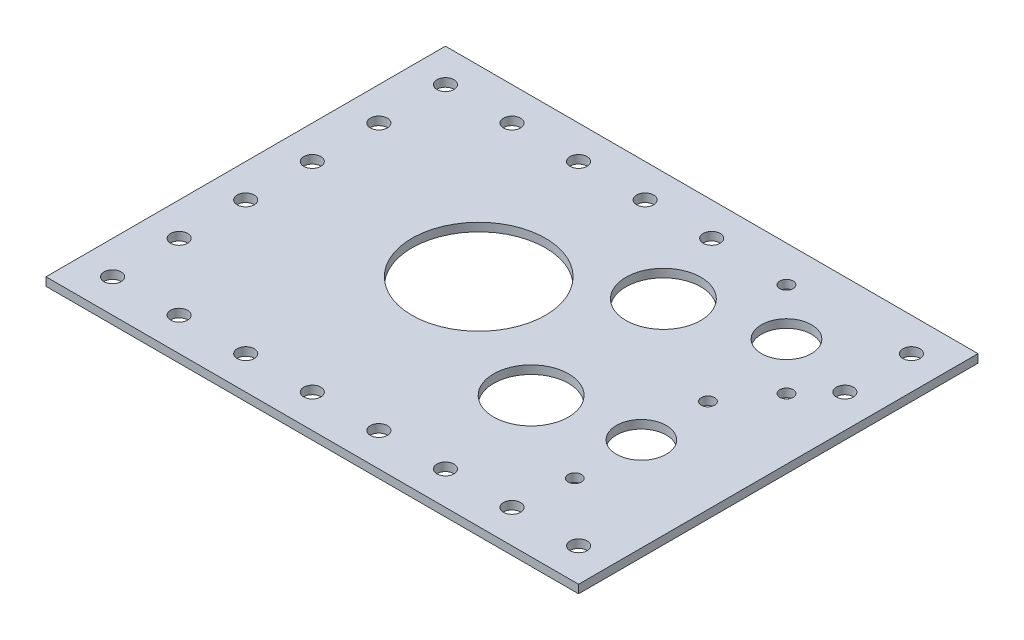
ISO-10303-21;
HEADER;
FILE_DESCRIPTION(('STEP AP214'),'2;1');
FILE_NAME('part.step','',(''),(''),'','','');
FILE_SCHEMA(('AUTOMOTIVE_DESIGN { 1 0 10303 214 1 1 1 1 }'));
ENDSEC;
DATA;
#1=APPLICATION_CONTEXT('core data for automotive mechanical design processes');
#2=APPLICATION_PROTOCOL_DEFINITION('international standard','automotive_design',2000,#1);
#3=PRODUCT_CONTEXT('',#1,'mechanical');
#4=PRODUCT('Part','Part','',(#3));
#5=PRODUCT_RELATED_PRODUCT_CATEGORY('part','',(#4));
#6=PRODUCT_DEFINITION_FORMATION('','',#4);
#7=PRODUCT_DEFINITION_CONTEXT('part definition',#1,'design');
#8=PRODUCT_DEFINITION('design','',#6,#7);
#9=PRODUCT_DEFINITION_SHAPE('','',#8);
#10=(LENGTH_UNIT() NAMED_UNIT(*) SI_UNIT(.MILLI.,.METRE.));
#11=(NAMED_UNIT(*) PLANE_ANGLE_UNIT() SI_UNIT($,.RADIAN.));
#12=(NAMED_UNIT(*) SI_UNIT($,.STERADIAN.) SOLID_ANGLE_UNIT());
#13=UNCERTAINTY_MEASURE_WITH_UNIT(LENGTH_MEASURE(1.E-05),#10,'distance_accuracy_value','');
#14=(GEOMETRIC_REPRESENTATION_CONTEXT(3) GLOBAL_UNCERTAINTY_ASSIGNED_CONTEXT((#13)) GLOBAL_UNIT_ASSIGNED_CONTEXT((#10,
#11,#12)) REPRESENTATION_CONTEXT('',''));
#15=CARTESIAN_POINT('',(0.,0.,0.));
#16=DIRECTION('',(0.,0.,1.));
#17=DIRECTION('',(1.,0.,0.));
#18=AXIS2_PLACEMENT_3D('',#15,#16,#17);
#19=CARTESIAN_POINT('',(0.,3.175,0.));
#20=DIRECTION('',(1.,0.,0.));
#21=DIRECTION('',(0.,0.,-1.));
#22=AXIS2_PLACEMENT_3D('',#19,#20,#21);
#23=PLANE('',#22);
#24=DIRECTION('',(0.,0.,1.));
#25=VECTOR('',#24,1.);
#26=CARTESIAN_POINT('',(0.,0.,0.));
#27=LINE('',#26,#25);
#28=CARTESIAN_POINT('',(0.,0.,-152.4));
#29=VERTEX_POINT('',#28);
#30=CARTESIAN_POINT('',(0.,0.,0.));
#31=VERTEX_POINT('',#30);
#32=EDGE_CURVE('E103',#29,#31,#27,.T.);
#33=ORIENTED_EDGE('',*,*,#32,.T.);
#34=DIRECTION('',(0.,-1.,0.));
#35=VECTOR('',#34,1.);
#36=CARTESIAN_POINT('',(0.,3.175,0.));
#37=LINE('',#36,#35);
#38=CARTESIAN_POINT('',(0.,3.175,0.));
#39=VERTEX_POINT('',#38);
#40=EDGE_CURVE('E11',#39,#31,#37,.T.);
#41=ORIENTED_EDGE('',*,*,#40,.F.);
#42=DIRECTION('',(0.,0.,1.));
#43=VECTOR('',#42,1.);
#44=CARTESIAN_POINT('',(0.,3.175,0.));
#45=LINE('',#44,#43);
#46=CARTESIAN_POINT('',(0.,3.175,-152.4));
#47=VERTEX_POINT('',#46);
#48=EDGE_CURVE('E90',#47,#39,#45,.T.);
#49=ORIENTED_EDGE('',*,*,#48,.F.);
#50=DIRECTION('',(0.,-1.,0.));
#51=VECTOR('',#50,1.);
#52=CARTESIAN_POINT('',(0.,3.175,-152.4));
#53=LINE('',#52,#51);
#54=EDGE_CURVE('E99',#47,#29,#53,.T.);
#55=ORIENTED_EDGE('',*,*,#54,.T.);
#56=EDGE_LOOP('',(#33,#41,#49,#55));
#57=FACE_BOUND('',#56,.T.);
#58=ADVANCED_FACE('F37',(#57),#23,.F.);
#59=CARTESIAN_POINT('',(0.,3.175,0.));
#60=DIRECTION('',(0.,0.,-1.));
#61=DIRECTION('',(-1.,0.,0.));
#62=AXIS2_PLACEMENT_3D('',#59,#60,#61);
#63=PLANE('',#62);
#64=DIRECTION('',(1.,0.,0.));
#65=VECTOR('',#64,1.);
#66=CARTESIAN_POINT('',(0.,0.,0.));
#67=LINE('',#66,#65);
#68=CARTESIAN_POINT('',(203.2,0.,0.));
#69=VERTEX_POINT('',#68);
#70=EDGE_CURVE('E94',#31,#69,#67,.T.);
#71=ORIENTED_EDGE('',*,*,#70,.T.);
#72=DIRECTION('',(0.,-1.,0.));
#73=VECTOR('',#72,1.);
#74=CARTESIAN_POINT('',(203.2,3.175,0.));
#75=LINE('',#74,#73);
#76=CARTESIAN_POINT('',(203.2,3.175,0.));
#77=VERTEX_POINT('',#76);
#78=EDGE_CURVE('E46',#77,#69,#75,.T.);
#79=ORIENTED_EDGE('',*,*,#78,.F.);
#80=DIRECTION('',(1.,0.,0.));
#81=VECTOR('',#80,1.);
#82=CARTESIAN_POINT('',(0.,3.175,0.));
#83=LINE('',#82,#81);
#84=EDGE_CURVE('E85',#39,#77,#83,.T.);
#85=ORIENTED_EDGE('',*,*,#84,.F.);
#86=ORIENTED_EDGE('',*,*,#40,.T.);
#87=EDGE_LOOP('',(#71,#79,#85,#86));
#88=FACE_BOUND('',#87,.T.);
#89=ADVANCED_FACE('F93',(#88),#63,.F.);
#90=CARTESIAN_POINT('',(203.2,3.175,0.));
#91=DIRECTION('',(-1.,0.,0.));
#92=DIRECTION('',(0.,0.,1.));
#93=AXIS2_PLACEMENT_3D('',#90,#91,#92);
#94=PLANE('',#93);
#95=DIRECTION('',(0.,0.,-1.));
#96=VECTOR('',#95,1.);
#97=CARTESIAN_POINT('',(203.2,0.,0.));
#98=LINE('',#97,#96);
#99=CARTESIAN_POINT('',(203.2,0.,-152.4));
#100=VERTEX_POINT('',#99);
#101=EDGE_CURVE('E72',#69,#100,#98,.T.);
#102=ORIENTED_EDGE('',*,*,#101,.T.);
#103=DIRECTION('',(0.,-1.,0.));
#104=VECTOR('',#103,1.);
#105=CARTESIAN_POINT('',(203.2,3.175,-152.4));
#106=LINE('',#105,#104);
#107=CARTESIAN_POINT('',(203.2,3.175,-152.4));
#108=VERTEX_POINT('',#107);
#109=EDGE_CURVE('E95',#108,#100,#106,.T.);
#110=ORIENTED_EDGE('',*,*,#109,.F.);
#111=DIRECTION('',(0.,0.,-1.));
#112=VECTOR('',#111,1.);
#113=CARTESIAN_POINT('',(203.2,3.175,0.));
#114=LINE('',#113,#112);
#115=EDGE_CURVE('E88',#77,#108,#114,.T.);
#116=ORIENTED_EDGE('',*,*,#115,.F.);
#117=ORIENTED_EDGE('',*,*,#78,.T.);
#118=EDGE_LOOP('',(#102,#110,#116,#117));
#119=FACE_BOUND('',#118,.T.);
#120=ADVANCED_FACE('F97',(#119),#94,.F.);
#121=CARTESIAN_POINT('',(0.,3.175,-152.4));
#122=DIRECTION('',(0.,0.,1.));
#123=DIRECTION('',(1.,0.,0.));
#124=AXIS2_PLACEMENT_3D('',#121,#122,#123);
#125=PLANE('',#124);
#126=DIRECTION('',(-1.,0.,0.));
#127=VECTOR('',#126,1.);
#128=CARTESIAN_POINT('',(0.,0.,-152.4));
#129=LINE('',#128,#127);
#130=EDGE_CURVE('E78',#100,#29,#129,.T.);
#131=ORIENTED_EDGE('',*,*,#130,.T.);
#132=ORIENTED_EDGE('',*,*,#54,.F.);
#133=DIRECTION('',(-1.,0.,0.));
#134=VECTOR('',#133,1.);
#135=CARTESIAN_POINT('',(0.,3.175,-152.4));
#136=LINE('',#135,#134);
#137=EDGE_CURVE('E55',#108,#47,#136,.T.);
#138=ORIENTED_EDGE('',*,*,#137,.F.);
#139=ORIENTED_EDGE('',*,*,#109,.T.);
#140=EDGE_LOOP('',(#131,#132,#138,#139));
#141=FACE_BOUND('',#140,.T.);
#142=ADVANCED_FACE('F284',(#141),#125,.F.);
#143=CARTESIAN_POINT('',(0.,3.175,0.));
#144=DIRECTION('',(0.,-1.,0.));
#145=DIRECTION('',(0.,0.,-1.));
#146=AXIS2_PLACEMENT_3D('',#143,#144,#145);
#147=PLANE('',#146);
#148=CARTESIAN_POINT('',(143.9164,3.175,-138.6078));
#149=DIRECTION('',(0.,1.,0.));
#150=DIRECTION('',(0.,0.,1.));
#151=AXIS2_PLACEMENT_3D('',#148,#149,#150);
#152=CIRCLE('',#151,2.53999999999998);
#153=CARTESIAN_POINT('',(143.9164,3.175,-136.0678));
#154=VERTEX_POINT('',#153);
#155=EDGE_CURVE('E226',#154,#154,#152,.T.);
#156=ORIENTED_EDGE('',*,*,#155,.F.);
#157=EDGE_LOOP('',(#156));
#158=FACE_BOUND('',#157,.T.);
#159=CARTESIAN_POINT('',(179.832,3.175,-102.6922));
#160=DIRECTION('',(0.,1.,0.));
#161=DIRECTION('',(0.,0.,1.));
#162=AXIS2_PLACEMENT_3D('',#159,#160,#161);
#163=CIRCLE('',#162,2.53999999999998);
#164=CARTESIAN_POINT('',(179.832,3.175,-100.1522));
#165=VERTEX_POINT('',#164);
#166=EDGE_CURVE('E216',#165,#165,#163,.T.);
#167=ORIENTED_EDGE('',*,*,#166,.F.);
#168=EDGE_LOOP('',(#167));
#169=FACE_BOUND('',#168,.T.);
#170=CARTESIAN_POINT('',(161.8742,3.175,-120.65));
#171=DIRECTION('',(0.,1.,0.));
#172=DIRECTION('',(0.,0.,1.));
#173=AXIS2_PLACEMENT_3D('',#170,#171,#172);
#174=CIRCLE('',#173,9.55039999999999);
#175=CARTESIAN_POINT('',(161.8742,3.175,-111.0996));
#176=VERTEX_POINT('',#175);
#177=EDGE_CURVE('E213',#176,#176,#174,.T.);
#178=ORIENTED_EDGE('',*,*,#177,.F.);
#179=EDGE_LOOP('',(#178));
#180=FACE_BOUND('',#179,.T.);
#181=CARTESIAN_POINT('',(125.0696,3.175,-110.49));
#182=DIRECTION('',(0.,1.,0.));
#183=DIRECTION('',(0.,0.,1.));
#184=AXIS2_PLACEMENT_3D('',#181,#182,#183);
#185=CIRCLE('',#184,14.2875);
#186=CARTESIAN_POINT('',(125.0696,3.175,-96.2025));
#187=VERTEX_POINT('',#186);
#188=EDGE_CURVE('E210',#187,#187,#185,.T.);
#189=ORIENTED_EDGE('',*,*,#188,.F.);
#190=EDGE_LOOP('',(#189));
#191=FACE_BOUND('',#190,.T.);
#192=CARTESIAN_POINT('',(167.4622,3.175,-85.09));
#193=DIRECTION('',(0.,1.,0.));
#194=DIRECTION('',(0.,0.,1.));
#195=AXIS2_PLACEMENT_3D('',#192,#193,#194);
#196=CIRCLE('',#195,2.53999999999998);
#197=CARTESIAN_POINT('',(167.4622,3.175,-82.55));
#198=VERTEX_POINT('',#197);
#199=EDGE_CURVE('E206',#198,#198,#196,.T.);
#200=ORIENTED_EDGE('',*,*,#199,.F.);
#201=EDGE_LOOP('',(#200));
#202=FACE_BOUND('',#201,.T.);
#203=CARTESIAN_POINT('',(167.4622,3.175,-34.29));
#204=DIRECTION('',(0.,1.,0.));
#205=DIRECTION('',(0.,0.,1.));
#206=AXIS2_PLACEMENT_3D('',#203,#204,#205);
#207=CIRCLE('',#206,2.53999999999998);
#208=CARTESIAN_POINT('',(167.4622,3.175,-31.75));
#209=VERTEX_POINT('',#208);
#210=EDGE_CURVE('E202',#209,#209,#207,.T.);
#211=ORIENTED_EDGE('',*,*,#210,.F.);
#212=EDGE_LOOP('',(#211));
#213=FACE_BOUND('',#212,.T.);
#214=CARTESIAN_POINT('',(167.4622,3.175,-59.69));
#215=DIRECTION('',(0.,1.,0.));
#216=DIRECTION('',(0.,0.,1.));
#217=AXIS2_PLACEMENT_3D('',#214,#215,#216);
#218=CIRCLE('',#217,9.525);
#219=CARTESIAN_POINT('',(167.4622,3.175,-50.165));
#220=VERTEX_POINT('',#219);
#221=EDGE_CURVE('E198',#220,#220,#218,.T.);
#222=ORIENTED_EDGE('',*,*,#221,.F.);
#223=EDGE_LOOP('',(#222));
#224=FACE_BOUND('',#223,.T.);
#225=CARTESIAN_POINT('',(131.7498,3.175,-53.34));
#226=DIRECTION('',(0.,1.,0.));
#227=DIRECTION('',(0.,0.,1.));
#228=AXIS2_PLACEMENT_3D('',#225,#226,#227);
#229=CIRCLE('',#228,14.2875);
#230=CARTESIAN_POINT('',(131.7498,3.175,-39.0525));
#231=VERTEX_POINT('',#230);
#232=EDGE_CURVE('E194',#231,#231,#229,.T.);
#233=ORIENTED_EDGE('',*,*,#232,.F.);
#234=EDGE_LOOP('',(#233));
#235=FACE_BOUND('',#234,.T.);
#236=CARTESIAN_POINT('',(82.55,3.175,-82.55));
#237=DIRECTION('',(0.,1.,0.));
#238=DIRECTION('',(0.,0.,1.));
#239=AXIS2_PLACEMENT_3D('',#236,#237,#238);
#240=CIRCLE('',#239,25.4762);
#241=CARTESIAN_POINT('',(82.55,3.175,-57.0738));
#242=VERTEX_POINT('',#241);
#243=EDGE_CURVE('E190',#242,#242,#240,.T.);
#244=ORIENTED_EDGE('',*,*,#243,.F.);
#245=EDGE_LOOP('',(#244));
#246=FACE_BOUND('',#245,.T.);
#247=CARTESIAN_POINT('',(114.3,3.175,-139.7));
#248=DIRECTION('',(0.,1.,0.));
#249=DIRECTION('',(0.,0.,1.));
#250=AXIS2_PLACEMENT_3D('',#247,#248,#249);
#251=CIRCLE('',#250,3.25119999999999);
#252=CARTESIAN_POINT('',(114.3,3.175,-136.4488));
#253=VERTEX_POINT('',#252);
#254=EDGE_CURVE('E186',#253,#253,#251,.T.);
#255=ORIENTED_EDGE('',*,*,#254,.F.);
#256=EDGE_LOOP('',(#255));
#257=FACE_BOUND('',#256,.T.);
#258=CARTESIAN_POINT('',(88.8999999999996,3.175,-139.7));
#259=DIRECTION('',(0.,1.,0.));
#260=DIRECTION('',(0.,0.,1.));
#261=AXIS2_PLACEMENT_3D('',#258,#259,#260);
#262=CIRCLE('',#261,3.25119999999999);
#263=CARTESIAN_POINT('',(88.8999999999996,3.175,-136.4488));
#264=VERTEX_POINT('',#263);
#265=EDGE_CURVE('E182',#264,#264,#262,.T.);
#266=ORIENTED_EDGE('',*,*,#265,.F.);
#267=EDGE_LOOP('',(#266));
#268=FACE_BOUND('',#267,.T.);
#269=CARTESIAN_POINT('',(63.4999999999996,3.175,-139.7));
#270=DIRECTION('',(0.,1.,0.));
#271=DIRECTION('',(0.,0.,1.));
#272=AXIS2_PLACEMENT_3D('',#269,#270,#271);
#273=CIRCLE('',#272,3.25119999999999);
#274=CARTESIAN_POINT('',(63.4999999999996,3.175,-136.4488));
#275=VERTEX_POINT('',#274);
#276=EDGE_CURVE('E178',#275,#275,#273,.T.);
#277=ORIENTED_EDGE('',*,*,#276,.F.);
#278=EDGE_LOOP('',(#277));
#279=FACE_BOUND('',#278,.T.);
#280=CARTESIAN_POINT('',(38.0999999999996,3.175,-139.7));
#281=DIRECTION('',(0.,1.,0.));
#282=DIRECTION('',(0.,0.,1.));
#283=AXIS2_PLACEMENT_3D('',#280,#281,#282);
#284=CIRCLE('',#283,3.25120000000001);
#285=CARTESIAN_POINT('',(38.0999999999996,3.175,-136.4488));
#286=VERTEX_POINT('',#285);
#287=EDGE_CURVE('E174',#286,#286,#284,.T.);
#288=ORIENTED_EDGE('',*,*,#287,.F.);
#289=EDGE_LOOP('',(#288));
#290=FACE_BOUND('',#289,.T.);
#291=CARTESIAN_POINT('',(12.6999999999996,3.175,-139.7));
#292=DIRECTION('',(0.,1.,0.));
#293=DIRECTION('',(0.,0.,1.));
#294=AXIS2_PLACEMENT_3D('',#291,#292,#293);
#295=CIRCLE('',#294,3.2512);
#296=CARTESIAN_POINT('',(12.6999999999996,3.175,-136.4488));
#297=VERTEX_POINT('',#296);
#298=EDGE_CURVE('E170',#297,#297,#295,.T.);
#299=ORIENTED_EDGE('',*,*,#298,.F.);
#300=EDGE_LOOP('',(#299));
#301=FACE_BOUND('',#300,.T.);
#302=CARTESIAN_POINT('',(12.6999999999996,3.175,-114.3));
#303=DIRECTION('',(0.,1.,0.));
#304=DIRECTION('',(0.,0.,1.));
#305=AXIS2_PLACEMENT_3D('',#302,#303,#304);
#306=CIRCLE('',#305,3.2512);
#307=CARTESIAN_POINT('',(12.6999999999996,3.175,-111.0488));
#308=VERTEX_POINT('',#307);
#309=EDGE_CURVE('E166',#308,#308,#306,.T.);
#310=ORIENTED_EDGE('',*,*,#309,.F.);
#311=EDGE_LOOP('',(#310));
#312=FACE_BOUND('',#311,.T.);
#313=CARTESIAN_POINT('',(12.6999999999997,3.175,-88.9));
#314=DIRECTION('',(0.,1.,0.));
#315=DIRECTION('',(0.,0.,1.));
#316=AXIS2_PLACEMENT_3D('',#313,#314,#315);
#317=CIRCLE('',#316,3.2512);
#318=CARTESIAN_POINT('',(12.6999999999997,3.175,-85.6488));
#319=VERTEX_POINT('',#318);
#320=EDGE_CURVE('E162',#319,#319,#317,.T.);
#321=ORIENTED_EDGE('',*,*,#320,.F.);
#322=EDGE_LOOP('',(#321));
#323=FACE_BOUND('',#322,.T.);
#324=CARTESIAN_POINT('',(12.6999999999998,3.175,-63.5));
#325=DIRECTION('',(0.,1.,0.));
#326=DIRECTION('',(0.,0.,1.));
#327=AXIS2_PLACEMENT_3D('',#324,#325,#326);
#328=CIRCLE('',#327,3.2512);
#329=CARTESIAN_POINT('',(12.6999999999998,3.175,-60.2488));
#330=VERTEX_POINT('',#329);
#331=EDGE_CURVE('E158',#330,#330,#328,.T.);
#332=ORIENTED_EDGE('',*,*,#331,.F.);
#333=EDGE_LOOP('',(#332));
#334=FACE_BOUND('',#333,.T.);
#335=CARTESIAN_POINT('',(12.6999999999999,3.175,-38.1));
#336=DIRECTION('',(0.,1.,0.));
#337=DIRECTION('',(0.,0.,1.));
#338=AXIS2_PLACEMENT_3D('',#335,#336,#337);
#339=CIRCLE('',#338,3.2512);
#340=CARTESIAN_POINT('',(12.6999999999999,3.175,-34.8488));
#341=VERTEX_POINT('',#340);
#342=EDGE_CURVE('E154',#341,#341,#339,.T.);
#343=ORIENTED_EDGE('',*,*,#342,.F.);
#344=EDGE_LOOP('',(#343));
#345=FACE_BOUND('',#344,.T.);
#346=CARTESIAN_POINT('',(190.5,3.175,-139.7));
#347=DIRECTION('',(0.,1.,0.));
#348=DIRECTION('',(0.,0.,1.));
#349=AXIS2_PLACEMENT_3D('',#346,#347,#348);
#350=CIRCLE('',#349,3.25120000000001);
#351=CARTESIAN_POINT('',(190.5,3.175,-136.4488));
#352=VERTEX_POINT('',#351);
#353=EDGE_CURVE('E150',#352,#352,#350,.T.);
#354=ORIENTED_EDGE('',*,*,#353,.F.);
#355=EDGE_LOOP('',(#354));
#356=FACE_BOUND('',#355,.T.);
#357=CARTESIAN_POINT('',(190.5,3.175,-114.3));
#358=DIRECTION('',(0.,1.,0.));
#359=DIRECTION('',(0.,0.,1.));
#360=AXIS2_PLACEMENT_3D('',#357,#358,#359);
#361=CIRCLE('',#360,3.25120000000001);
#362=CARTESIAN_POINT('',(190.5,3.175,-111.0488));
#363=VERTEX_POINT('',#362);
#364=EDGE_CURVE('E146',#363,#363,#361,.T.);
#365=ORIENTED_EDGE('',*,*,#364,.F.);
#366=EDGE_LOOP('',(#365));
#367=FACE_BOUND('',#366,.T.);
#368=CARTESIAN_POINT('',(190.5,3.175,-12.7));
#369=DIRECTION('',(0.,1.,0.));
#370=DIRECTION('',(0.,0.,1.));
#371=AXIS2_PLACEMENT_3D('',#368,#369,#370);
#372=CIRCLE('',#371,3.25120000000001);
#373=CARTESIAN_POINT('',(190.5,3.175,-9.44879999999999));
#374=VERTEX_POINT('',#373);
#375=EDGE_CURVE('E142',#374,#374,#372,.T.);
#376=ORIENTED_EDGE('',*,*,#375,.F.);
#377=EDGE_LOOP('',(#376));
#378=FACE_BOUND('',#377,.T.);
#379=CARTESIAN_POINT('',(165.1,3.175,-12.7));
#380=DIRECTION('',(0.,1.,0.));
#381=DIRECTION('',(0.,0.,1.));
#382=AXIS2_PLACEMENT_3D('',#379,#380,#381);
#383=CIRCLE('',#382,3.25120000000001);
#384=CARTESIAN_POINT('',(165.1,3.175,-9.44879999999999));
#385=VERTEX_POINT('',#384);
#386=EDGE_CURVE('E138',#385,#385,#383,.T.);
#387=ORIENTED_EDGE('',*,*,#386,.F.);
#388=EDGE_LOOP('',(#387));
#389=FACE_BOUND('',#388,.T.);
#390=CARTESIAN_POINT('',(139.7,3.175,-12.7));
#391=DIRECTION('',(0.,1.,0.));
#392=DIRECTION('',(0.,0.,1.));
#393=AXIS2_PLACEMENT_3D('',#390,#391,#392);
#394=CIRCLE('',#393,3.25120000000001);
#395=CARTESIAN_POINT('',(139.7,3.175,-9.44879999999999));
#396=VERTEX_POINT('',#395);
#397=EDGE_CURVE('E134',#396,#396,#394,.T.);
#398=ORIENTED_EDGE('',*,*,#397,.F.);
#399=EDGE_LOOP('',(#398));
#400=FACE_BOUND('',#399,.T.);
#401=CARTESIAN_POINT('',(114.3,3.175,-12.7));
#402=DIRECTION('',(0.,1.,0.));
#403=DIRECTION('',(0.,0.,1.));
#404=AXIS2_PLACEMENT_3D('',#401,#402,#403);
#405=CIRCLE('',#404,3.25119999999999);
#406=CARTESIAN_POINT('',(114.3,3.175,-9.44880000000001));
#407=VERTEX_POINT('',#406);
#408=EDGE_CURVE('E130',#407,#407,#405,.T.);
#409=ORIENTED_EDGE('',*,*,#408,.F.);
#410=EDGE_LOOP('',(#409));
#411=FACE_BOUND('',#410,.T.);
#412=CARTESIAN_POINT('',(88.9,3.175,-12.7));
#413=DIRECTION('',(0.,1.,0.));
#414=DIRECTION('',(0.,0.,1.));
#415=AXIS2_PLACEMENT_3D('',#412,#413,#414);
#416=CIRCLE('',#415,3.25119999999999);
#417=CARTESIAN_POINT('',(88.9,3.175,-9.44880000000001));
#418=VERTEX_POINT('',#417);
#419=EDGE_CURVE('E126',#418,#418,#416,.T.);
#420=ORIENTED_EDGE('',*,*,#419,.F.);
#421=EDGE_LOOP('',(#420));
#422=FACE_BOUND('',#421,.T.);
#423=CARTESIAN_POINT('',(63.5,3.175,-12.7));
#424=DIRECTION('',(0.,1.,0.));
#425=DIRECTION('',(0.,0.,1.));
#426=AXIS2_PLACEMENT_3D('',#423,#424,#425);
#427=CIRCLE('',#426,3.25119999999999);
#428=CARTESIAN_POINT('',(63.5,3.175,-9.44880000000001));
#429=VERTEX_POINT('',#428);
#430=EDGE_CURVE('E122',#429,#429,#427,.T.);
#431=ORIENTED_EDGE('',*,*,#430,.F.);
#432=EDGE_LOOP('',(#431));
#433=FACE_BOUND('',#432,.T.);
#434=CARTESIAN_POINT('',(38.1,3.175,-12.7));
#435=DIRECTION('',(0.,1.,0.));
#436=DIRECTION('',(0.,0.,1.));
#437=AXIS2_PLACEMENT_3D('',#434,#435,#436);
#438=CIRCLE('',#437,3.25120000000001);
#439=CARTESIAN_POINT('',(38.1,3.175,-9.44879999999999));
#440=VERTEX_POINT('',#439);
#441=EDGE_CURVE('E118',#440,#440,#438,.T.);
#442=ORIENTED_EDGE('',*,*,#441,.F.);
#443=EDGE_LOOP('',(#442));
#444=FACE_BOUND('',#443,.T.);
#445=CARTESIAN_POINT('',(12.7,3.175,-12.7));
#446=DIRECTION('',(0.,1.,0.));
#447=DIRECTION('',(0.,0.,1.));
#448=AXIS2_PLACEMENT_3D('',#445,#446,#447);
#449=CIRCLE('',#448,3.2512);
#450=CARTESIAN_POINT('',(12.7,3.175,-9.4488));
#451=VERTEX_POINT('',#450);
#452=EDGE_CURVE('E114',#451,#451,#449,.T.);
#453=ORIENTED_EDGE('',*,*,#452,.F.);
#454=EDGE_LOOP('',(#453));
#455=FACE_BOUND('',#454,.T.);
#456=ORIENTED_EDGE('',*,*,#48,.T.);
#457=ORIENTED_EDGE('',*,*,#84,.T.);
#458=ORIENTED_EDGE('',*,*,#115,.T.);
#459=ORIENTED_EDGE('',*,*,#137,.T.);
#460=EDGE_LOOP('',(#456,#457,#458,#459));
#461=FACE_BOUND('',#460,.T.);
#462=ADVANCED_FACE('F86',(#158,#169,#180,#191,#202,#213,#224,#235,#246,#257,#268,#279,#290,#301,
#312,#323,#334,#345,#356,#367,#378,#389,#400,#411,#422,#433,#444,#455,#461),#147,.F.);
#463=CARTESIAN_POINT('',(0.,0.,0.));
#464=DIRECTION('',(0.,-1.,0.));
#465=DIRECTION('',(0.,0.,-1.));
#466=AXIS2_PLACEMENT_3D('',#463,#464,#465);
#467=PLANE('',#466);
#468=CARTESIAN_POINT('',(143.9164,0.,-138.6078));
#469=DIRECTION('',(0.,-1.,0.));
#470=DIRECTION('',(0.,0.,-1.));
#471=AXIS2_PLACEMENT_3D('',#468,#469,#470);
#472=CIRCLE('',#471,2.53999999999998);
#473=CARTESIAN_POINT('',(143.9164,0.,-141.1478));
#474=VERTEX_POINT('',#473);
#475=EDGE_CURVE('E40',#474,#474,#472,.T.);
#476=ORIENTED_EDGE('',*,*,#475,.F.);
#477=EDGE_LOOP('',(#476));
#478=FACE_BOUND('',#477,.T.);
#479=CARTESIAN_POINT('',(179.832,0.,-102.6922));
#480=DIRECTION('',(0.,-1.,0.));
#481=DIRECTION('',(0.,0.,-1.));
#482=AXIS2_PLACEMENT_3D('',#479,#480,#481);
#483=CIRCLE('',#482,2.53999999999998);
#484=CARTESIAN_POINT('',(179.832,0.,-105.2322));
#485=VERTEX_POINT('',#484);
#486=EDGE_CURVE('E214',#485,#485,#483,.T.);
#487=ORIENTED_EDGE('',*,*,#486,.F.);
#488=EDGE_LOOP('',(#487));
#489=FACE_BOUND('',#488,.T.);
#490=CARTESIAN_POINT('',(161.8742,0.,-120.65));
#491=DIRECTION('',(0.,-1.,0.));
#492=DIRECTION('',(0.,0.,-1.));
#493=AXIS2_PLACEMENT_3D('',#490,#491,#492);
#494=CIRCLE('',#493,9.55039999999999);
#495=CARTESIAN_POINT('',(161.8742,0.,-130.2004));
#496=VERTEX_POINT('',#495);
#497=EDGE_CURVE('E211',#496,#496,#494,.T.);
#498=ORIENTED_EDGE('',*,*,#497,.F.);
#499=EDGE_LOOP('',(#498));
#500=FACE_BOUND('',#499,.T.);
#501=CARTESIAN_POINT('',(125.0696,0.,-110.49));
#502=DIRECTION('',(0.,-1.,0.));
#503=DIRECTION('',(0.,0.,-1.));
#504=AXIS2_PLACEMENT_3D('',#501,#502,#503);
#505=CIRCLE('',#504,14.2875);
#506=CARTESIAN_POINT('',(125.0696,0.,-124.7775));
#507=VERTEX_POINT('',#506);
#508=EDGE_CURVE('E207',#507,#507,#505,.T.);
#509=ORIENTED_EDGE('',*,*,#508,.F.);
#510=EDGE_LOOP('',(#509));
#511=FACE_BOUND('',#510,.T.);
#512=CARTESIAN_POINT('',(167.4622,0.,-85.09));
#513=DIRECTION('',(0.,-1.,0.));
#514=DIRECTION('',(0.,0.,-1.));
#515=AXIS2_PLACEMENT_3D('',#512,#513,#514);
#516=CIRCLE('',#515,2.53999999999998);
#517=CARTESIAN_POINT('',(167.4622,0.,-87.63));
#518=VERTEX_POINT('',#517);
#519=EDGE_CURVE('E203',#518,#518,#516,.T.);
#520=ORIENTED_EDGE('',*,*,#519,.F.);
#521=EDGE_LOOP('',(#520));
#522=FACE_BOUND('',#521,.T.);
#523=CARTESIAN_POINT('',(167.4622,0.,-34.29));
#524=DIRECTION('',(0.,-1.,0.));
#525=DIRECTION('',(0.,0.,-1.));
#526=AXIS2_PLACEMENT_3D('',#523,#524,#525);
#527=CIRCLE('',#526,2.53999999999998);
#528=CARTESIAN_POINT('',(167.4622,0.,-36.83));
#529=VERTEX_POINT('',#528);
#530=EDGE_CURVE('E199',#529,#529,#527,.T.);
#531=ORIENTED_EDGE('',*,*,#530,.F.);
#532=EDGE_LOOP('',(#531));
#533=FACE_BOUND('',#532,.T.);
#534=CARTESIAN_POINT('',(167.4622,0.,-59.69));
#535=DIRECTION('',(0.,-1.,0.));
#536=DIRECTION('',(0.,0.,-1.));
#537=AXIS2_PLACEMENT_3D('',#534,#535,#536);
#538=CIRCLE('',#537,9.525);
#539=CARTESIAN_POINT('',(167.4622,0.,-69.215));
#540=VERTEX_POINT('',#539);
#541=EDGE_CURVE('E195',#540,#540,#538,.T.);
#542=ORIENTED_EDGE('',*,*,#541,.F.);
#543=EDGE_LOOP('',(#542));
#544=FACE_BOUND('',#543,.T.);
#545=CARTESIAN_POINT('',(131.7498,0.,-53.34));
#546=DIRECTION('',(0.,-1.,0.));
#547=DIRECTION('',(0.,0.,-1.));
#548=AXIS2_PLACEMENT_3D('',#545,#546,#547);
#549=CIRCLE('',#548,14.2875);
#550=CARTESIAN_POINT('',(131.7498,0.,-67.6275));
#551=VERTEX_POINT('',#550);
#552=EDGE_CURVE('E191',#551,#551,#549,.T.);
#553=ORIENTED_EDGE('',*,*,#552,.F.);
#554=EDGE_LOOP('',(#553));
#555=FACE_BOUND('',#554,.T.);
#556=CARTESIAN_POINT('',(82.55,0.,-82.55));
#557=DIRECTION('',(0.,-1.,0.));
#558=DIRECTION('',(0.,0.,-1.));
#559=AXIS2_PLACEMENT_3D('',#556,#557,#558);
#560=CIRCLE('',#559,25.4762);
#561=CARTESIAN_POINT('',(82.55,0.,-108.0262));
#562=VERTEX_POINT('',#561);
#563=EDGE_CURVE('E187',#562,#562,#560,.T.);
#564=ORIENTED_EDGE('',*,*,#563,.F.);
#565=EDGE_LOOP('',(#564));
#566=FACE_BOUND('',#565,.T.);
#567=CARTESIAN_POINT('',(114.3,0.,-139.7));
#568=DIRECTION('',(0.,-1.,0.));
#569=DIRECTION('',(0.,0.,-1.));
#570=AXIS2_PLACEMENT_3D('',#567,#568,#569);
#571=CIRCLE('',#570,3.25119999999999);
#572=CARTESIAN_POINT('',(114.3,0.,-142.9512));
#573=VERTEX_POINT('',#572);
#574=EDGE_CURVE('E183',#573,#573,#571,.T.);
#575=ORIENTED_EDGE('',*,*,#574,.F.);
#576=EDGE_LOOP('',(#575));
#577=FACE_BOUND('',#576,.T.);
#578=CARTESIAN_POINT('',(88.8999999999996,0.,-139.7));
#579=DIRECTION('',(0.,-1.,0.));
#580=DIRECTION('',(0.,0.,-1.));
#581=AXIS2_PLACEMENT_3D('',#578,#579,#580);
#582=CIRCLE('',#581,3.25119999999999);
#583=CARTESIAN_POINT('',(88.8999999999996,0.,-142.9512));
#584=VERTEX_POINT('',#583);
#585=EDGE_CURVE('E179',#584,#584,#582,.T.);
#586=ORIENTED_EDGE('',*,*,#585,.F.);
#587=EDGE_LOOP('',(#586));
#588=FACE_BOUND('',#587,.T.);
#589=CARTESIAN_POINT('',(63.4999999999996,0.,-139.7));
#590=DIRECTION('',(0.,-1.,0.));
#591=DIRECTION('',(0.,0.,-1.));
#592=AXIS2_PLACEMENT_3D('',#589,#590,#591);
#593=CIRCLE('',#592,3.25119999999999);
#594=CARTESIAN_POINT('',(63.4999999999996,0.,-142.9512));
#595=VERTEX_POINT('',#594);
#596=EDGE_CURVE('E175',#595,#595,#593,.T.);
#597=ORIENTED_EDGE('',*,*,#596,.F.);
#598=EDGE_LOOP('',(#597));
#599=FACE_BOUND('',#598,.T.);
#600=CARTESIAN_POINT('',(38.0999999999996,0.,-139.7));
#601=DIRECTION('',(0.,-1.,0.));
#602=DIRECTION('',(0.,0.,-1.));
#603=AXIS2_PLACEMENT_3D('',#600,#601,#602);
#604=CIRCLE('',#603,3.25120000000001);
#605=CARTESIAN_POINT('',(38.0999999999996,0.,-142.9512));
#606=VERTEX_POINT('',#605);
#607=EDGE_CURVE('E171',#606,#606,#604,.T.);
#608=ORIENTED_EDGE('',*,*,#607,.F.);
#609=EDGE_LOOP('',(#608));
#610=FACE_BOUND('',#609,.T.);
#611=CARTESIAN_POINT('',(12.6999999999996,0.,-139.7));
#612=DIRECTION('',(0.,-1.,0.));
#613=DIRECTION('',(0.,0.,-1.));
#614=AXIS2_PLACEMENT_3D('',#611,#612,#613);
#615=CIRCLE('',#614,3.2512);
#616=CARTESIAN_POINT('',(12.6999999999996,0.,-142.9512));
#617=VERTEX_POINT('',#616);
#618=EDGE_CURVE('E167',#617,#617,#615,.T.);
#619=ORIENTED_EDGE('',*,*,#618,.F.);
#620=EDGE_LOOP('',(#619));
#621=FACE_BOUND('',#620,.T.);
#622=CARTESIAN_POINT('',(12.6999999999996,0.,-114.3));
#623=DIRECTION('',(0.,-1.,0.));
#624=DIRECTION('',(0.,0.,-1.));
#625=AXIS2_PLACEMENT_3D('',#622,#623,#624);
#626=CIRCLE('',#625,3.2512);
#627=CARTESIAN_POINT('',(12.6999999999996,0.,-117.5512));
#628=VERTEX_POINT('',#627);
#629=EDGE_CURVE('E163',#628,#628,#626,.T.);
#630=ORIENTED_EDGE('',*,*,#629,.F.);
#631=EDGE_LOOP('',(#630));
#632=FACE_BOUND('',#631,.T.);
#633=CARTESIAN_POINT('',(12.6999999999997,0.,-88.9));
#634=DIRECTION('',(0.,-1.,0.));
#635=DIRECTION('',(0.,0.,-1.));
#636=AXIS2_PLACEMENT_3D('',#633,#634,#635);
#637=CIRCLE('',#636,3.2512);
#638=CARTESIAN_POINT('',(12.6999999999997,0.,-92.1512));
#639=VERTEX_POINT('',#638);
#640=EDGE_CURVE('E159',#639,#639,#637,.T.);
#641=ORIENTED_EDGE('',*,*,#640,.F.);
#642=EDGE_LOOP('',(#641));
#643=FACE_BOUND('',#642,.T.);
#644=CARTESIAN_POINT('',(12.6999999999998,0.,-63.5));
#645=DIRECTION('',(0.,-1.,0.));
#646=DIRECTION('',(0.,0.,-1.));
#647=AXIS2_PLACEMENT_3D('',#644,#645,#646);
#648=CIRCLE('',#647,3.2512);
#649=CARTESIAN_POINT('',(12.6999999999998,0.,-66.7512));
#650=VERTEX_POINT('',#649);
#651=EDGE_CURVE('E155',#650,#650,#648,.T.);
#652=ORIENTED_EDGE('',*,*,#651,.F.);
#653=EDGE_LOOP('',(#652));
#654=FACE_BOUND('',#653,.T.);
#655=CARTESIAN_POINT('',(12.6999999999999,0.,-38.1));
#656=DIRECTION('',(0.,-1.,0.));
#657=DIRECTION('',(0.,0.,-1.));
#658=AXIS2_PLACEMENT_3D('',#655,#656,#657);
#659=CIRCLE('',#658,3.2512);
#660=CARTESIAN_POINT('',(12.6999999999999,0.,-41.3512));
#661=VERTEX_POINT('',#660);
#662=EDGE_CURVE('E151',#661,#661,#659,.T.);
#663=ORIENTED_EDGE('',*,*,#662,.F.);
#664=EDGE_LOOP('',(#663));
#665=FACE_BOUND('',#664,.T.);
#666=CARTESIAN_POINT('',(190.5,0.,-139.7));
#667=DIRECTION('',(0.,-1.,0.));
#668=DIRECTION('',(0.,0.,-1.));
#669=AXIS2_PLACEMENT_3D('',#666,#667,#668);
#670=CIRCLE('',#669,3.25120000000001);
#671=CARTESIAN_POINT('',(190.5,0.,-142.9512));
#672=VERTEX_POINT('',#671);
#673=EDGE_CURVE('E147',#672,#672,#670,.T.);
#674=ORIENTED_EDGE('',*,*,#673,.F.);
#675=EDGE_LOOP('',(#674));
#676=FACE_BOUND('',#675,.T.);
#677=CARTESIAN_POINT('',(190.5,0.,-114.3));
#678=DIRECTION('',(0.,-1.,0.));
#679=DIRECTION('',(0.,0.,-1.));
#680=AXIS2_PLACEMENT_3D('',#677,#678,#679);
#681=CIRCLE('',#680,3.25120000000001);
#682=CARTESIAN_POINT('',(190.5,0.,-117.5512));
#683=VERTEX_POINT('',#682);
#684=EDGE_CURVE('E143',#683,#683,#681,.T.);
#685=ORIENTED_EDGE('',*,*,#684,.F.);
#686=EDGE_LOOP('',(#685));
#687=FACE_BOUND('',#686,.T.);
#688=CARTESIAN_POINT('',(190.5,0.,-12.7));
#689=DIRECTION('',(0.,-1.,0.));
#690=DIRECTION('',(0.,0.,-1.));
#691=AXIS2_PLACEMENT_3D('',#688,#689,#690);
#692=CIRCLE('',#691,3.25120000000001);
#693=CARTESIAN_POINT('',(190.5,0.,-15.9512));
#694=VERTEX_POINT('',#693);
#695=EDGE_CURVE('E139',#694,#694,#692,.T.);
#696=ORIENTED_EDGE('',*,*,#695,.F.);
#697=EDGE_LOOP('',(#696));
#698=FACE_BOUND('',#697,.T.);
#699=CARTESIAN_POINT('',(165.1,0.,-12.7));
#700=DIRECTION('',(0.,-1.,0.));
#701=DIRECTION('',(0.,0.,-1.));
#702=AXIS2_PLACEMENT_3D('',#699,#700,#701);
#703=CIRCLE('',#702,3.25120000000001);
#704=CARTESIAN_POINT('',(165.1,0.,-15.9512));
#705=VERTEX_POINT('',#704);
#706=EDGE_CURVE('E135',#705,#705,#703,.T.);
#707=ORIENTED_EDGE('',*,*,#706,.F.);
#708=EDGE_LOOP('',(#707));
#709=FACE_BOUND('',#708,.T.);
#710=CARTESIAN_POINT('',(139.7,0.,-12.7));
#711=DIRECTION('',(0.,-1.,0.));
#712=DIRECTION('',(0.,0.,-1.));
#713=AXIS2_PLACEMENT_3D('',#710,#711,#712);
#714=CIRCLE('',#713,3.25120000000001);
#715=CARTESIAN_POINT('',(139.7,0.,-15.9512));
#716=VERTEX_POINT('',#715);
#717=EDGE_CURVE('E131',#716,#716,#714,.T.);
#718=ORIENTED_EDGE('',*,*,#717,.F.);
#719=EDGE_LOOP('',(#718));
#720=FACE_BOUND('',#719,.T.);
#721=CARTESIAN_POINT('',(114.3,0.,-12.7));
#722=DIRECTION('',(0.,-1.,0.));
#723=DIRECTION('',(0.,0.,-1.));
#724=AXIS2_PLACEMENT_3D('',#721,#722,#723);
#725=CIRCLE('',#724,3.25119999999999);
#726=CARTESIAN_POINT('',(114.3,0.,-15.9512));
#727=VERTEX_POINT('',#726);
#728=EDGE_CURVE('E127',#727,#727,#725,.T.);
#729=ORIENTED_EDGE('',*,*,#728,.F.);
#730=EDGE_LOOP('',(#729));
#731=FACE_BOUND('',#730,.T.);
#732=CARTESIAN_POINT('',(88.9,0.,-12.7));
#733=DIRECTION('',(0.,-1.,0.));
#734=DIRECTION('',(0.,0.,-1.));
#735=AXIS2_PLACEMENT_3D('',#732,#733,#734);
#736=CIRCLE('',#735,3.25119999999999);
#737=CARTESIAN_POINT('',(88.9,0.,-15.9512));
#738=VERTEX_POINT('',#737);
#739=EDGE_CURVE('E123',#738,#738,#736,.T.);
#740=ORIENTED_EDGE('',*,*,#739,.F.);
#741=EDGE_LOOP('',(#740));
#742=FACE_BOUND('',#741,.T.);
#743=CARTESIAN_POINT('',(63.5,0.,-12.7));
#744=DIRECTION('',(0.,-1.,0.));
#745=DIRECTION('',(0.,0.,-1.));
#746=AXIS2_PLACEMENT_3D('',#743,#744,#745);
#747=CIRCLE('',#746,3.25119999999999);
#748=CARTESIAN_POINT('',(63.5,0.,-15.9512));
#749=VERTEX_POINT('',#748);
#750=EDGE_CURVE('E119',#749,#749,#747,.T.);
#751=ORIENTED_EDGE('',*,*,#750,.F.);
#752=EDGE_LOOP('',(#751));
#753=FACE_BOUND('',#752,.T.);
#754=CARTESIAN_POINT('',(38.1,0.,-12.7));
#755=DIRECTION('',(0.,-1.,0.));
#756=DIRECTION('',(0.,0.,-1.));
#757=AXIS2_PLACEMENT_3D('',#754,#755,#756);
#758=CIRCLE('',#757,3.25120000000001);
#759=CARTESIAN_POINT('',(38.1,0.,-15.9512));
#760=VERTEX_POINT('',#759);
#761=EDGE_CURVE('E115',#760,#760,#758,.T.);
#762=ORIENTED_EDGE('',*,*,#761,.F.);
#763=EDGE_LOOP('',(#762));
#764=FACE_BOUND('',#763,.T.);
#765=CARTESIAN_POINT('',(12.7,0.,-12.7));
#766=DIRECTION('',(0.,-1.,0.));
#767=DIRECTION('',(0.,0.,-1.));
#768=AXIS2_PLACEMENT_3D('',#765,#766,#767);
#769=CIRCLE('',#768,3.2512);
#770=CARTESIAN_POINT('',(12.7,0.,-15.9512));
#771=VERTEX_POINT('',#770);
#772=EDGE_CURVE('E106',#771,#771,#769,.T.);
#773=ORIENTED_EDGE('',*,*,#772,.F.);
#774=EDGE_LOOP('',(#773));
#775=FACE_BOUND('',#774,.T.);
#776=ORIENTED_EDGE('',*,*,#32,.F.);
#777=ORIENTED_EDGE('',*,*,#130,.F.);
#778=ORIENTED_EDGE('',*,*,#101,.F.);
#779=ORIENTED_EDGE('',*,*,#70,.F.);
#780=EDGE_LOOP('',(#776,#777,#778,#779));
#781=FACE_BOUND('',#780,.T.);
#782=ADVANCED_FACE('F283',(#478,#489,#500,#511,#522,#533,#544,#555,#566,#577,#588,#599,#610,
#621,#632,#643,#654,#665,#676,#687,#698,#709,#720,#731,#742,#753,#764,#775,#781),#467,.T.);
#783=CARTESIAN_POINT('',(12.7,-1.905,-12.7));
#784=DIRECTION('',(0.,1.,0.));
#785=DIRECTION('',(0.,0.,1.));
#786=AXIS2_PLACEMENT_3D('',#783,#784,#785);
#787=CYLINDRICAL_SURFACE('',#786,3.2512);
#788=ORIENTED_EDGE('',*,*,#772,.T.);
#789=EDGE_LOOP('',(#788));
#790=FACE_BOUND('',#789,.T.);
#791=ORIENTED_EDGE('',*,*,#452,.T.);
#792=EDGE_LOOP('',(#791));
#793=FACE_BOUND('',#792,.T.);
#794=ADVANCED_FACE('F280',(#790,#793),#787,.F.);
#795=CARTESIAN_POINT('',(38.1,-1.905,-12.7));
#796=DIRECTION('',(0.,1.,0.));
#797=DIRECTION('',(0.,0.,1.));
#798=AXIS2_PLACEMENT_3D('',#795,#796,#797);
#799=CYLINDRICAL_SURFACE('',#798,3.25120000000001);
#800=ORIENTED_EDGE('',*,*,#761,.T.);
#801=EDGE_LOOP('',(#800));
#802=FACE_BOUND('',#801,.T.);
#803=ORIENTED_EDGE('',*,*,#441,.T.);
#804=EDGE_LOOP('',(#803));
#805=FACE_BOUND('',#804,.T.);
#806=ADVANCED_FACE('F330',(#802,#805),#799,.F.);
#807=CARTESIAN_POINT('',(63.5,-1.905,-12.7));
#808=DIRECTION('',(0.,1.,0.));
#809=DIRECTION('',(0.,0.,1.));
#810=AXIS2_PLACEMENT_3D('',#807,#808,#809);
#811=CYLINDRICAL_SURFACE('',#810,3.25119999999999);
#812=ORIENTED_EDGE('',*,*,#750,.T.);
#813=EDGE_LOOP('',(#812));
#814=FACE_BOUND('',#813,.T.);
#815=ORIENTED_EDGE('',*,*,#430,.T.);
#816=EDGE_LOOP('',(#815));
#817=FACE_BOUND('',#816,.T.);
#818=ADVANCED_FACE('F341',(#814,#817),#811,.F.);
#819=CARTESIAN_POINT('',(88.9,-1.905,-12.7));
#820=DIRECTION('',(0.,1.,0.));
#821=DIRECTION('',(0.,0.,1.));
#822=AXIS2_PLACEMENT_3D('',#819,#820,#821);
#823=CYLINDRICAL_SURFACE('',#822,3.25119999999999);
#824=ORIENTED_EDGE('',*,*,#739,.T.);
#825=EDGE_LOOP('',(#824));
#826=FACE_BOUND('',#825,.T.);
#827=ORIENTED_EDGE('',*,*,#419,.T.);
#828=EDGE_LOOP('',(#827));
#829=FACE_BOUND('',#828,.T.);
#830=ADVANCED_FACE('F352',(#826,#829),#823,.F.);
#831=CARTESIAN_POINT('',(114.3,-1.905,-12.7));
#832=DIRECTION('',(0.,1.,0.));
#833=DIRECTION('',(0.,0.,1.));
#834=AXIS2_PLACEMENT_3D('',#831,#832,#833);
#835=CYLINDRICAL_SURFACE('',#834,3.25119999999999);
#836=ORIENTED_EDGE('',*,*,#728,.T.);
#837=EDGE_LOOP('',(#836));
#838=FACE_BOUND('',#837,.T.);
#839=ORIENTED_EDGE('',*,*,#408,.T.);
#840=EDGE_LOOP('',(#839));
#841=FACE_BOUND('',#840,.T.);
#842=ADVANCED_FACE('F363',(#838,#841),#835,.F.);
#843=CARTESIAN_POINT('',(139.7,-1.905,-12.7));
#844=DIRECTION('',(0.,1.,0.));
#845=DIRECTION('',(0.,0.,1.));
#846=AXIS2_PLACEMENT_3D('',#843,#844,#845);
#847=CYLINDRICAL_SURFACE('',#846,3.25120000000001);
#848=ORIENTED_EDGE('',*,*,#717,.T.);
#849=EDGE_LOOP('',(#848));
#850=FACE_BOUND('',#849,.T.);
#851=ORIENTED_EDGE('',*,*,#397,.T.);
#852=EDGE_LOOP('',(#851));
#853=FACE_BOUND('',#852,.T.);
#854=ADVANCED_FACE('F374',(#850,#853),#847,.F.);
#855=CARTESIAN_POINT('',(165.1,-1.905,-12.7));
#856=DIRECTION('',(0.,1.,0.));
#857=DIRECTION('',(0.,0.,1.));
#858=AXIS2_PLACEMENT_3D('',#855,#856,#857);
#859=CYLINDRICAL_SURFACE('',#858,3.25120000000001);
#860=ORIENTED_EDGE('',*,*,#706,.T.);
#861=EDGE_LOOP('',(#860));
#862=FACE_BOUND('',#861,.T.);
#863=ORIENTED_EDGE('',*,*,#386,.T.);
#864=EDGE_LOOP('',(#863));
#865=FACE_BOUND('',#864,.T.);
#866=ADVANCED_FACE('F385',(#862,#865),#859,.F.);
#867=CARTESIAN_POINT('',(190.5,-1.905,-12.7));
#868=DIRECTION('',(0.,1.,0.));
#869=DIRECTION('',(0.,0.,1.));
#870=AXIS2_PLACEMENT_3D('',#867,#868,#869);
#871=CYLINDRICAL_SURFACE('',#870,3.25120000000001);
#872=ORIENTED_EDGE('',*,*,#695,.T.);
#873=EDGE_LOOP('',(#872));
#874=FACE_BOUND('',#873,.T.);
#875=ORIENTED_EDGE('',*,*,#375,.T.);
#876=EDGE_LOOP('',(#875));
#877=FACE_BOUND('',#876,.T.);
#878=ADVANCED_FACE('F396',(#874,#877),#871,.F.);
#879=CARTESIAN_POINT('',(190.5,-1.905,-114.3));
#880=DIRECTION('',(0.,1.,0.));
#881=DIRECTION('',(0.,0.,1.));
#882=AXIS2_PLACEMENT_3D('',#879,#880,#881);
#883=CYLINDRICAL_SURFACE('',#882,3.25120000000001);
#884=ORIENTED_EDGE('',*,*,#684,.T.);
#885=EDGE_LOOP('',(#884));
#886=FACE_BOUND('',#885,.T.);
#887=ORIENTED_EDGE('',*,*,#364,.T.);
#888=EDGE_LOOP('',(#887));
#889=FACE_BOUND('',#888,.T.);
#890=ADVANCED_FACE('F407',(#886,#889),#883,.F.);
#891=CARTESIAN_POINT('',(190.5,-1.905,-139.7));
#892=DIRECTION('',(0.,1.,0.));
#893=DIRECTION('',(0.,0.,1.));
#894=AXIS2_PLACEMENT_3D('',#891,#892,#893);
#895=CYLINDRICAL_SURFACE('',#894,3.25120000000001);
#896=ORIENTED_EDGE('',*,*,#673,.T.);
#897=EDGE_LOOP('',(#896));
#898=FACE_BOUND('',#897,.T.);
#899=ORIENTED_EDGE('',*,*,#353,.T.);
#900=EDGE_LOOP('',(#899));
#901=FACE_BOUND('',#900,.T.);
#902=ADVANCED_FACE('F418',(#898,#901),#895,.F.);
#903=CARTESIAN_POINT('',(12.6999999999999,-1.905,-38.1));
#904=DIRECTION('',(0.,1.,0.));
#905=DIRECTION('',(0.,0.,1.));
#906=AXIS2_PLACEMENT_3D('',#903,#904,#905);
#907=CYLINDRICAL_SURFACE('',#906,3.2512);
#908=ORIENTED_EDGE('',*,*,#662,.T.);
#909=EDGE_LOOP('',(#908));
#910=FACE_BOUND('',#909,.T.);
#911=ORIENTED_EDGE('',*,*,#342,.T.);
#912=EDGE_LOOP('',(#911));
#913=FACE_BOUND('',#912,.T.);
#914=ADVANCED_FACE('F429',(#910,#913),#907,.F.);
#915=CARTESIAN_POINT('',(12.6999999999998,-1.905,-63.5));
#916=DIRECTION('',(0.,1.,0.));
#917=DIRECTION('',(0.,0.,1.));
#918=AXIS2_PLACEMENT_3D('',#915,#916,#917);
#919=CYLINDRICAL_SURFACE('',#918,3.2512);
#920=ORIENTED_EDGE('',*,*,#651,.T.);
#921=EDGE_LOOP('',(#920));
#922=FACE_BOUND('',#921,.T.);
#923=ORIENTED_EDGE('',*,*,#331,.T.);
#924=EDGE_LOOP('',(#923));
#925=FACE_BOUND('',#924,.T.);
#926=ADVANCED_FACE('F440',(#922,#925),#919,.F.);
#927=CARTESIAN_POINT('',(12.6999999999997,-1.905,-88.9));
#928=DIRECTION('',(0.,1.,0.));
#929=DIRECTION('',(0.,0.,1.));
#930=AXIS2_PLACEMENT_3D('',#927,#928,#929);
#931=CYLINDRICAL_SURFACE('',#930,3.2512);
#932=ORIENTED_EDGE('',*,*,#640,.T.);
#933=EDGE_LOOP('',(#932));
#934=FACE_BOUND('',#933,.T.);
#935=ORIENTED_EDGE('',*,*,#320,.T.);
#936=EDGE_LOOP('',(#935));
#937=FACE_BOUND('',#936,.T.);
#938=ADVANCED_FACE('F451',(#934,#937),#931,.F.);
#939=CARTESIAN_POINT('',(12.6999999999996,-1.905,-114.3));
#940=DIRECTION('',(0.,1.,0.));
#941=DIRECTION('',(0.,0.,1.));
#942=AXIS2_PLACEMENT_3D('',#939,#940,#941);
#943=CYLINDRICAL_SURFACE('',#942,3.2512);
#944=ORIENTED_EDGE('',*,*,#629,.T.);
#945=EDGE_LOOP('',(#944));
#946=FACE_BOUND('',#945,.T.);
#947=ORIENTED_EDGE('',*,*,#309,.T.);
#948=EDGE_LOOP('',(#947));
#949=FACE_BOUND('',#948,.T.);
#950=ADVANCED_FACE('F462',(#946,#949),#943,.F.);
#951=CARTESIAN_POINT('',(12.6999999999996,-1.905,-139.7));
#952=DIRECTION('',(0.,1.,0.));
#953=DIRECTION('',(0.,0.,1.));
#954=AXIS2_PLACEMENT_3D('',#951,#952,#953);
#955=CYLINDRICAL_SURFACE('',#954,3.2512);
#956=ORIENTED_EDGE('',*,*,#618,.T.);
#957=EDGE_LOOP('',(#956));
#958=FACE_BOUND('',#957,.T.);
#959=ORIENTED_EDGE('',*,*,#298,.T.);
#960=EDGE_LOOP('',(#959));
#961=FACE_BOUND('',#960,.T.);
#962=ADVANCED_FACE('F473',(#958,#961),#955,.F.);
#963=CARTESIAN_POINT('',(38.0999999999996,-1.905,-139.7));
#964=DIRECTION('',(0.,1.,0.));
#965=DIRECTION('',(0.,0.,1.));
#966=AXIS2_PLACEMENT_3D('',#963,#964,#965);
#967=CYLINDRICAL_SURFACE('',#966,3.25120000000001);
#968=ORIENTED_EDGE('',*,*,#607,.T.);
#969=EDGE_LOOP('',(#968));
#970=FACE_BOUND('',#969,.T.);
#971=ORIENTED_EDGE('',*,*,#287,.T.);
#972=EDGE_LOOP('',(#971));
#973=FACE_BOUND('',#972,.T.);
#974=ADVANCED_FACE('F484',(#970,#973),#967,.F.);
#975=CARTESIAN_POINT('',(63.4999999999996,-1.905,-139.7));
#976=DIRECTION('',(0.,1.,0.));
#977=DIRECTION('',(0.,0.,1.));
#978=AXIS2_PLACEMENT_3D('',#975,#976,#977);
#979=CYLINDRICAL_SURFACE('',#978,3.25119999999999);
#980=ORIENTED_EDGE('',*,*,#596,.T.);
#981=EDGE_LOOP('',(#980));
#982=FACE_BOUND('',#981,.T.);
#983=ORIENTED_EDGE('',*,*,#276,.T.);
#984=EDGE_LOOP('',(#983));
#985=FACE_BOUND('',#984,.T.);
#986=ADVANCED_FACE('F495',(#982,#985),#979,.F.);
#987=CARTESIAN_POINT('',(88.8999999999996,-1.905,-139.7));
#988=DIRECTION('',(0.,1.,0.));
#989=DIRECTION('',(0.,0.,1.));
#990=AXIS2_PLACEMENT_3D('',#987,#988,#989);
#991=CYLINDRICAL_SURFACE('',#990,3.25119999999999);
#992=ORIENTED_EDGE('',*,*,#585,.T.);
#993=EDGE_LOOP('',(#992));
#994=FACE_BOUND('',#993,.T.);
#995=ORIENTED_EDGE('',*,*,#265,.T.);
#996=EDGE_LOOP('',(#995));
#997=FACE_BOUND('',#996,.T.);
#998=ADVANCED_FACE('F506',(#994,#997),#991,.F.);
#999=CARTESIAN_POINT('',(114.3,-1.905,-139.7));
#1000=DIRECTION('',(0.,1.,0.));
#1001=DIRECTION('',(0.,0.,1.));
#1002=AXIS2_PLACEMENT_3D('',#999,#1000,#1001);
#1003=CYLINDRICAL_SURFACE('',#1002,3.25119999999999);
#1004=ORIENTED_EDGE('',*,*,#574,.T.);
#1005=EDGE_LOOP('',(#1004));
#1006=FACE_BOUND('',#1005,.T.);
#1007=ORIENTED_EDGE('',*,*,#254,.T.);
#1008=EDGE_LOOP('',(#1007));
#1009=FACE_BOUND('',#1008,.T.);
#1010=ADVANCED_FACE('F517',(#1006,#1009),#1003,.F.);
#1011=CARTESIAN_POINT('',(82.55,-47.625,-82.55));
#1012=DIRECTION('',(0.,1.,0.));
#1013=DIRECTION('',(0.,0.,1.));
#1014=AXIS2_PLACEMENT_3D('',#1011,#1012,#1013);
#1015=CYLINDRICAL_SURFACE('',#1014,25.4762);
#1016=ORIENTED_EDGE('',*,*,#563,.T.);
#1017=EDGE_LOOP('',(#1016));
#1018=FACE_BOUND('',#1017,.T.);
#1019=ORIENTED_EDGE('',*,*,#243,.T.);
#1020=EDGE_LOOP('',(#1019));
#1021=FACE_BOUND('',#1020,.T.);
#1022=ADVANCED_FACE('F528',(#1018,#1021),#1015,.F.);
#1023=CARTESIAN_POINT('',(131.7498,-47.625,-53.34));
#1024=DIRECTION('',(0.,1.,0.));
#1025=DIRECTION('',(0.,0.,1.));
#1026=AXIS2_PLACEMENT_3D('',#1023,#1024,#1025);
#1027=CYLINDRICAL_SURFACE('',#1026,14.2875);
#1028=ORIENTED_EDGE('',*,*,#552,.T.);
#1029=EDGE_LOOP('',(#1028));
#1030=FACE_BOUND('',#1029,.T.);
#1031=ORIENTED_EDGE('',*,*,#232,.T.);
#1032=EDGE_LOOP('',(#1031));
#1033=FACE_BOUND('',#1032,.T.);
#1034=ADVANCED_FACE('F549',(#1030,#1033),#1027,.F.);
#1035=CARTESIAN_POINT('',(167.4622,-47.625,-59.69));
#1036=DIRECTION('',(0.,1.,0.));
#1037=DIRECTION('',(0.,0.,1.));
#1038=AXIS2_PLACEMENT_3D('',#1035,#1036,#1037);
#1039=CYLINDRICAL_SURFACE('',#1038,9.525);
#1040=ORIENTED_EDGE('',*,*,#541,.T.);
#1041=EDGE_LOOP('',(#1040));
#1042=FACE_BOUND('',#1041,.T.);
#1043=ORIENTED_EDGE('',*,*,#221,.T.);
#1044=EDGE_LOOP('',(#1043));
#1045=FACE_BOUND('',#1044,.T.);
#1046=ADVANCED_FACE('F559',(#1042,#1045),#1039,.F.);
#1047=CARTESIAN_POINT('',(167.4622,-47.625,-34.29));
#1048=DIRECTION('',(0.,1.,0.));
#1049=DIRECTION('',(0.,0.,1.));
#1050=AXIS2_PLACEMENT_3D('',#1047,#1048,#1049);
#1051=CYLINDRICAL_SURFACE('',#1050,2.53999999999998);
#1052=ORIENTED_EDGE('',*,*,#530,.T.);
#1053=EDGE_LOOP('',(#1052));
#1054=FACE_BOUND('',#1053,.T.);
#1055=ORIENTED_EDGE('',*,*,#210,.T.);
#1056=EDGE_LOOP('',(#1055));
#1057=FACE_BOUND('',#1056,.T.);
#1058=ADVANCED_FACE('F569',(#1054,#1057),#1051,.F.);
#1059=CARTESIAN_POINT('',(167.4622,-47.625,-85.09));
#1060=DIRECTION('',(0.,1.,0.));
#1061=DIRECTION('',(0.,0.,1.));
#1062=AXIS2_PLACEMENT_3D('',#1059,#1060,#1061);
#1063=CYLINDRICAL_SURFACE('',#1062,2.53999999999998);
#1064=ORIENTED_EDGE('',*,*,#519,.T.);
#1065=EDGE_LOOP('',(#1064));
#1066=FACE_BOUND('',#1065,.T.);
#1067=ORIENTED_EDGE('',*,*,#199,.T.);
#1068=EDGE_LOOP('',(#1067));
#1069=FACE_BOUND('',#1068,.T.);
#1070=ADVANCED_FACE('F579',(#1066,#1069),#1063,.F.);
#1071=CARTESIAN_POINT('',(125.0696,-47.625,-110.49));
#1072=DIRECTION('',(0.,1.,0.));
#1073=DIRECTION('',(0.,0.,1.));
#1074=AXIS2_PLACEMENT_3D('',#1071,#1072,#1073);
#1075=CYLINDRICAL_SURFACE('',#1074,14.2875);
#1076=ORIENTED_EDGE('',*,*,#508,.T.);
#1077=EDGE_LOOP('',(#1076));
#1078=FACE_BOUND('',#1077,.T.);
#1079=ORIENTED_EDGE('',*,*,#188,.T.);
#1080=EDGE_LOOP('',(#1079));
#1081=FACE_BOUND('',#1080,.T.);
#1082=ADVANCED_FACE('F589',(#1078,#1081),#1075,.F.);
#1083=CARTESIAN_POINT('',(161.8742,-47.625,-120.65));
#1084=DIRECTION('',(0.,1.,0.));
#1085=DIRECTION('',(0.,0.,1.));
#1086=AXIS2_PLACEMENT_3D('',#1083,#1084,#1085);
#1087=CYLINDRICAL_SURFACE('',#1086,9.55039999999999);
#1088=ORIENTED_EDGE('',*,*,#497,.T.);
#1089=EDGE_LOOP('',(#1088));
#1090=FACE_BOUND('',#1089,.T.);
#1091=ORIENTED_EDGE('',*,*,#177,.T.);
#1092=EDGE_LOOP('',(#1091));
#1093=FACE_BOUND('',#1092,.T.);
#1094=ADVANCED_FACE('F599',(#1090,#1093),#1087,.F.);
#1095=CARTESIAN_POINT('',(179.832,-47.625,-102.6922));
#1096=DIRECTION('',(0.,1.,0.));
#1097=DIRECTION('',(0.,0.,1.));
#1098=AXIS2_PLACEMENT_3D('',#1095,#1096,#1097);
#1099=CYLINDRICAL_SURFACE('',#1098,2.53999999999998);
#1100=ORIENTED_EDGE('',*,*,#486,.T.);
#1101=EDGE_LOOP('',(#1100));
#1102=FACE_BOUND('',#1101,.T.);
#1103=ORIENTED_EDGE('',*,*,#166,.T.);
#1104=EDGE_LOOP('',(#1103));
#1105=FACE_BOUND('',#1104,.T.);
#1106=ADVANCED_FACE('F609',(#1102,#1105),#1099,.F.);
#1107=CARTESIAN_POINT('',(143.9164,-47.625,-138.6078));
#1108=DIRECTION('',(0.,1.,0.));
#1109=DIRECTION('',(0.,0.,1.));
#1110=AXIS2_PLACEMENT_3D('',#1107,#1108,#1109);
#1111=CYLINDRICAL_SURFACE('',#1110,2.53999999999998);
#1112=ORIENTED_EDGE('',*,*,#475,.T.);
#1113=EDGE_LOOP('',(#1112));
#1114=FACE_BOUND('',#1113,.T.);
#1115=ORIENTED_EDGE('',*,*,#155,.T.);
#1116=EDGE_LOOP('',(#1115));
#1117=FACE_BOUND('',#1116,.T.);
#1118=ADVANCED_FACE('F619',(#1114,#1117),#1111,.F.);
#1119=CLOSED_SHELL('',(#58,#89,#120,#142,#462,#782,#794,#806,#818,#830,#842,#854,#866,#878,#890,
#902,#914,#926,#938,#950,#962,#974,#986,#998,#1010,#1022,#1034,#1046,#1058,#1070,#1082,#1094,
#1106,#1118));
#1120=MANIFOLD_SOLID_BREP('B2',#1119);
#1121=ADVANCED_BREP_SHAPE_REPRESENTATION('',(#18,#1120),#14);
#1122=SHAPE_DEFINITION_REPRESENTATION(#9,#1121);
ENDSEC;
END-ISO-10303-21;
